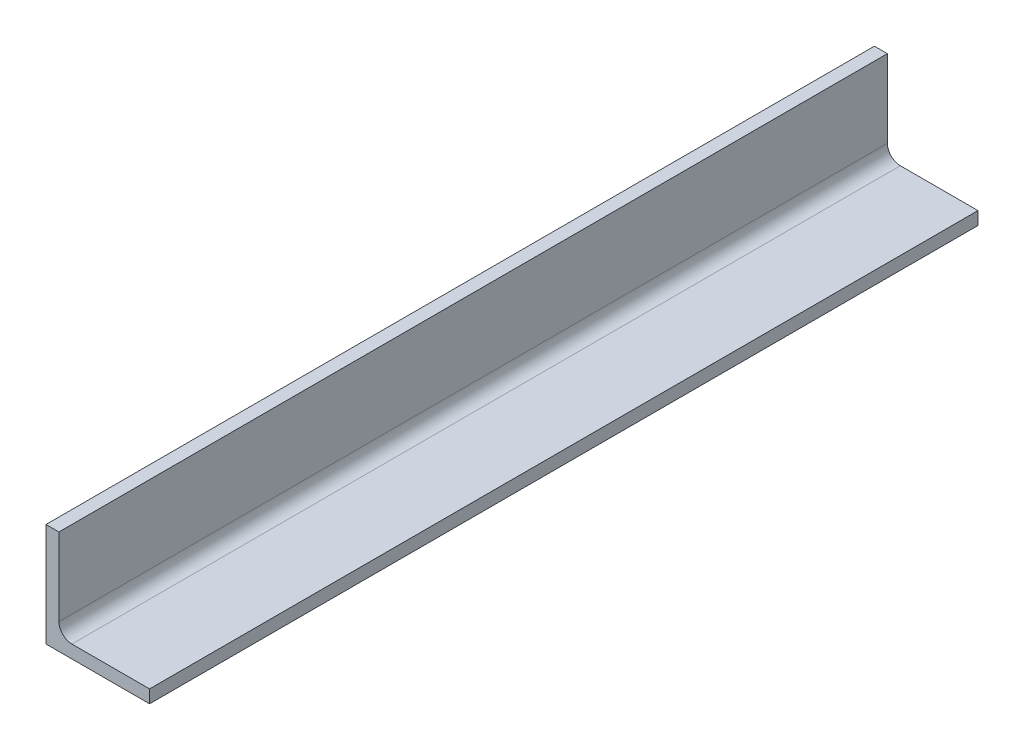
ISO-10303-21;
HEADER;
FILE_DESCRIPTION(('STEP AP214'),'2;1');
FILE_NAME('part.step','',(''),(''),'','','');
FILE_SCHEMA(('AUTOMOTIVE_DESIGN { 1 0 10303 214 1 1 1 1 }'));
ENDSEC;
DATA;
#1=APPLICATION_CONTEXT('core data for automotive mechanical design processes');
#2=APPLICATION_PROTOCOL_DEFINITION('international standard','automotive_design',2000,#1);
#3=PRODUCT_CONTEXT('',#1,'mechanical');
#4=PRODUCT('Part','Part','',(#3));
#5=PRODUCT_RELATED_PRODUCT_CATEGORY('part','',(#4));
#6=PRODUCT_DEFINITION_FORMATION('','',#4);
#7=PRODUCT_DEFINITION_CONTEXT('part definition',#1,'design');
#8=PRODUCT_DEFINITION('design','',#6,#7);
#9=PRODUCT_DEFINITION_SHAPE('','',#8);
#10=(LENGTH_UNIT() NAMED_UNIT(*) SI_UNIT(.MILLI.,.METRE.));
#11=(NAMED_UNIT(*) PLANE_ANGLE_UNIT() SI_UNIT($,.RADIAN.));
#12=(NAMED_UNIT(*) SI_UNIT($,.STERADIAN.) SOLID_ANGLE_UNIT());
#13=UNCERTAINTY_MEASURE_WITH_UNIT(LENGTH_MEASURE(1.E-05),#10,'distance_accuracy_value','');
#14=(GEOMETRIC_REPRESENTATION_CONTEXT(3) GLOBAL_UNCERTAINTY_ASSIGNED_CONTEXT((#13)) GLOBAL_UNIT_ASSIGNED_CONTEXT((#10,
#11,#12)) REPRESENTATION_CONTEXT('',''));
#15=CARTESIAN_POINT('',(0.,0.,0.));
#16=DIRECTION('',(0.,0.,1.));
#17=DIRECTION('',(1.,0.,0.));
#18=AXIS2_PLACEMENT_3D('',#15,#16,#17);
#19=CARTESIAN_POINT('',(50.8,0.,203.2));
#20=DIRECTION('',(0.,1.,0.));
#21=DIRECTION('',(-1.,0.,0.));
#22=AXIS2_PLACEMENT_3D('',#19,#20,#21);
#23=PLANE('',#22);
#24=DIRECTION('',(1.,0.,0.));
#25=VECTOR('',#24,1.);
#26=CARTESIAN_POINT('',(50.8,0.,-203.2));
#27=LINE('',#26,#25);
#28=CARTESIAN_POINT('',(0.,0.,-203.2));
#29=VERTEX_POINT('',#28);
#30=CARTESIAN_POINT('',(50.8,0.,-203.2));
#31=VERTEX_POINT('',#30);
#32=EDGE_CURVE('E107',#29,#31,#27,.T.);
#33=ORIENTED_EDGE('',*,*,#32,.T.);
#34=DIRECTION('',(0.,0.,-1.));
#35=VECTOR('',#34,1.);
#36=CARTESIAN_POINT('',(50.8,0.,203.2));
#37=LINE('',#36,#35);
#38=CARTESIAN_POINT('',(50.8,0.,203.2));
#39=VERTEX_POINT('',#38);
#40=EDGE_CURVE('E11',#39,#31,#37,.T.);
#41=ORIENTED_EDGE('',*,*,#40,.F.);
#42=DIRECTION('',(1.,0.,0.));
#43=VECTOR('',#42,1.);
#44=CARTESIAN_POINT('',(50.8,0.,203.2));
#45=LINE('',#44,#43);
#46=CARTESIAN_POINT('',(0.,0.,203.2));
#47=VERTEX_POINT('',#46);
#48=EDGE_CURVE('E119',#47,#39,#45,.T.);
#49=ORIENTED_EDGE('',*,*,#48,.F.);
#50=DIRECTION('',(0.,0.,-1.));
#51=VECTOR('',#50,1.);
#52=CARTESIAN_POINT('',(0.,0.,203.2));
#53=LINE('',#52,#51);
#54=EDGE_CURVE('E103',#47,#29,#53,.T.);
#55=ORIENTED_EDGE('',*,*,#54,.T.);
#56=EDGE_LOOP('',(#33,#41,#49,#55));
#57=FACE_BOUND('',#56,.T.);
#58=ADVANCED_FACE('F17',(#57),#23,.F.);
#59=CARTESIAN_POINT('',(50.8,6.35,203.2));
#60=DIRECTION('',(-1.,0.,0.));
#61=DIRECTION('',(0.,0.,1.));
#62=AXIS2_PLACEMENT_3D('',#59,#60,#61);
#63=PLANE('',#62);
#64=DIRECTION('',(0.,1.,0.));
#65=VECTOR('',#64,1.);
#66=CARTESIAN_POINT('',(50.8,6.35,-203.2));
#67=LINE('',#66,#65);
#68=CARTESIAN_POINT('',(50.8,6.35,-203.2));
#69=VERTEX_POINT('',#68);
#70=EDGE_CURVE('E110',#31,#69,#67,.T.);
#71=ORIENTED_EDGE('',*,*,#70,.T.);
#72=DIRECTION('',(0.,0.,-1.));
#73=VECTOR('',#72,1.);
#74=CARTESIAN_POINT('',(50.8,6.35,203.2));
#75=LINE('',#74,#73);
#76=CARTESIAN_POINT('',(50.8,6.35,203.2));
#77=VERTEX_POINT('',#76);
#78=EDGE_CURVE('E25',#77,#69,#75,.T.);
#79=ORIENTED_EDGE('',*,*,#78,.F.);
#80=DIRECTION('',(0.,1.,0.));
#81=VECTOR('',#80,1.);
#82=CARTESIAN_POINT('',(50.8,6.35,203.2));
#83=LINE('',#82,#81);
#84=EDGE_CURVE('E73',#39,#77,#83,.T.);
#85=ORIENTED_EDGE('',*,*,#84,.F.);
#86=ORIENTED_EDGE('',*,*,#40,.T.);
#87=EDGE_LOOP('',(#71,#79,#85,#86));
#88=FACE_BOUND('',#87,.T.);
#89=ADVANCED_FACE('F144',(#88),#63,.F.);
#90=CARTESIAN_POINT('',(12.7,6.35,203.2));
#91=DIRECTION('',(0.,-1.,0.));
#92=DIRECTION('',(0.,0.,-1.));
#93=AXIS2_PLACEMENT_3D('',#90,#91,#92);
#94=PLANE('',#93);
#95=DIRECTION('',(-1.,0.,0.));
#96=VECTOR('',#95,1.);
#97=CARTESIAN_POINT('',(12.7,6.35,-203.2));
#98=LINE('',#97,#96);
#99=CARTESIAN_POINT('',(12.7,6.35,-203.2));
#100=VERTEX_POINT('',#99);
#101=EDGE_CURVE('E112',#69,#100,#98,.T.);
#102=ORIENTED_EDGE('',*,*,#101,.T.);
#103=DIRECTION('',(0.,0.,-1.));
#104=VECTOR('',#103,1.);
#105=CARTESIAN_POINT('',(12.7,6.35,203.2));
#106=LINE('',#105,#104);
#107=CARTESIAN_POINT('',(12.7,6.35,203.2));
#108=VERTEX_POINT('',#107);
#109=EDGE_CURVE('E123',#108,#100,#106,.T.);
#110=ORIENTED_EDGE('',*,*,#109,.F.);
#111=DIRECTION('',(-1.,0.,0.));
#112=VECTOR('',#111,1.);
#113=CARTESIAN_POINT('',(12.7,6.35,203.2));
#114=LINE('',#113,#112);
#115=EDGE_CURVE('E131',#77,#108,#114,.T.);
#116=ORIENTED_EDGE('',*,*,#115,.F.);
#117=ORIENTED_EDGE('',*,*,#78,.T.);
#118=EDGE_LOOP('',(#102,#110,#116,#117));
#119=FACE_BOUND('',#118,.T.);
#120=ADVANCED_FACE('F129',(#119),#94,.F.);
#121=CARTESIAN_POINT('',(12.7,12.7,203.2));
#122=DIRECTION('',(0.,0.,-1.));
#123=DIRECTION('',(-1.,0.,0.));
#124=AXIS2_PLACEMENT_3D('',#121,#122,#123);
#125=CYLINDRICAL_SURFACE('',#124,6.35);
#126=CARTESIAN_POINT('',(12.7,12.7,-203.2));
#127=DIRECTION('',(0.,0.,-1.));
#128=DIRECTION('',(-1.,0.,0.));
#129=AXIS2_PLACEMENT_3D('',#126,#127,#128);
#130=CIRCLE('',#129,6.35);
#131=CARTESIAN_POINT('',(6.35,12.7,-203.2));
#132=VERTEX_POINT('',#131);
#133=EDGE_CURVE('E114',#100,#132,#130,.T.);
#134=ORIENTED_EDGE('',*,*,#133,.T.);
#135=DIRECTION('',(0.,0.,-1.));
#136=VECTOR('',#135,1.);
#137=CARTESIAN_POINT('',(6.35,12.7,203.2));
#138=LINE('',#137,#136);
#139=CARTESIAN_POINT('',(6.35,12.7,203.2));
#140=VERTEX_POINT('',#139);
#141=EDGE_CURVE('E98',#140,#132,#138,.T.);
#142=ORIENTED_EDGE('',*,*,#141,.F.);
#143=CARTESIAN_POINT('',(12.7,12.7,203.2));
#144=DIRECTION('',(0.,0.,-1.));
#145=DIRECTION('',(-1.,0.,0.));
#146=AXIS2_PLACEMENT_3D('',#143,#144,#145);
#147=CIRCLE('',#146,6.35);
#148=EDGE_CURVE('E89',#108,#140,#147,.T.);
#149=ORIENTED_EDGE('',*,*,#148,.F.);
#150=ORIENTED_EDGE('',*,*,#109,.T.);
#151=EDGE_LOOP('',(#134,#142,#149,#150));
#152=FACE_BOUND('',#151,.T.);
#153=ADVANCED_FACE('F137',(#152),#125,.F.);
#154=CARTESIAN_POINT('',(6.35,50.8,203.2));
#155=DIRECTION('',(-1.,0.,0.));
#156=DIRECTION('',(0.,-1.,0.));
#157=AXIS2_PLACEMENT_3D('',#154,#155,#156);
#158=PLANE('',#157);
#159=DIRECTION('',(0.,1.,0.));
#160=VECTOR('',#159,1.);
#161=CARTESIAN_POINT('',(6.35,50.8,-203.2));
#162=LINE('',#161,#160);
#163=CARTESIAN_POINT('',(6.35,50.8,-203.2));
#164=VERTEX_POINT('',#163);
#165=EDGE_CURVE('E97',#132,#164,#162,.T.);
#166=ORIENTED_EDGE('',*,*,#165,.T.);
#167=DIRECTION('',(0.,0.,-1.));
#168=VECTOR('',#167,1.);
#169=CARTESIAN_POINT('',(6.35,50.8,203.2));
#170=LINE('',#169,#168);
#171=CARTESIAN_POINT('',(6.35,50.8,203.2));
#172=VERTEX_POINT('',#171);
#173=EDGE_CURVE('E94',#172,#164,#170,.T.);
#174=ORIENTED_EDGE('',*,*,#173,.F.);
#175=DIRECTION('',(0.,1.,0.));
#176=VECTOR('',#175,1.);
#177=CARTESIAN_POINT('',(6.35,50.8,203.2));
#178=LINE('',#177,#176);
#179=EDGE_CURVE('E83',#140,#172,#178,.T.);
#180=ORIENTED_EDGE('',*,*,#179,.F.);
#181=ORIENTED_EDGE('',*,*,#141,.T.);
#182=EDGE_LOOP('',(#166,#174,#180,#181));
#183=FACE_BOUND('',#182,.T.);
#184=ADVANCED_FACE('F95',(#183),#158,.F.);
#185=CARTESIAN_POINT('',(0.,50.8,203.2));
#186=DIRECTION('',(0.,-1.,0.));
#187=DIRECTION('',(0.,0.,-1.));
#188=AXIS2_PLACEMENT_3D('',#185,#186,#187);
#189=PLANE('',#188);
#190=DIRECTION('',(-1.,0.,0.));
#191=VECTOR('',#190,1.);
#192=CARTESIAN_POINT('',(0.,50.8,-203.2));
#193=LINE('',#192,#191);
#194=CARTESIAN_POINT('',(0.,50.8,-203.2));
#195=VERTEX_POINT('',#194);
#196=EDGE_CURVE('E59',#164,#195,#193,.T.);
#197=ORIENTED_EDGE('',*,*,#196,.T.);
#198=DIRECTION('',(0.,0.,-1.));
#199=VECTOR('',#198,1.);
#200=CARTESIAN_POINT('',(0.,50.8,203.2));
#201=LINE('',#200,#199);
#202=CARTESIAN_POINT('',(0.,50.8,203.2));
#203=VERTEX_POINT('',#202);
#204=EDGE_CURVE('E99',#203,#195,#201,.T.);
#205=ORIENTED_EDGE('',*,*,#204,.F.);
#206=DIRECTION('',(-1.,0.,0.));
#207=VECTOR('',#206,1.);
#208=CARTESIAN_POINT('',(0.,50.8,203.2));
#209=LINE('',#208,#207);
#210=EDGE_CURVE('E87',#172,#203,#209,.T.);
#211=ORIENTED_EDGE('',*,*,#210,.F.);
#212=ORIENTED_EDGE('',*,*,#173,.T.);
#213=EDGE_LOOP('',(#197,#205,#211,#212));
#214=FACE_BOUND('',#213,.T.);
#215=ADVANCED_FACE('F101',(#214),#189,.F.);
#216=CARTESIAN_POINT('',(0.,0.,203.2));
#217=DIRECTION('',(1.,0.,0.));
#218=DIRECTION('',(0.,0.,-1.));
#219=AXIS2_PLACEMENT_3D('',#216,#217,#218);
#220=PLANE('',#219);
#221=DIRECTION('',(0.,-1.,0.));
#222=VECTOR('',#221,1.);
#223=CARTESIAN_POINT('',(0.,0.,-203.2));
#224=LINE('',#223,#222);
#225=EDGE_CURVE('E65',#195,#29,#224,.T.);
#226=ORIENTED_EDGE('',*,*,#225,.T.);
#227=ORIENTED_EDGE('',*,*,#54,.F.);
#228=DIRECTION('',(0.,-1.,0.));
#229=VECTOR('',#228,1.);
#230=CARTESIAN_POINT('',(0.,0.,203.2));
#231=LINE('',#230,#229);
#232=EDGE_CURVE('E33',#203,#47,#231,.T.);
#233=ORIENTED_EDGE('',*,*,#232,.F.);
#234=ORIENTED_EDGE('',*,*,#204,.T.);
#235=EDGE_LOOP('',(#226,#227,#233,#234));
#236=FACE_BOUND('',#235,.T.);
#237=ADVANCED_FACE('F160',(#236),#220,.F.);
#238=CARTESIAN_POINT('',(12.7,12.7,203.2));
#239=DIRECTION('',(0.,0.,-1.));
#240=DIRECTION('',(-1.,0.,0.));
#241=AXIS2_PLACEMENT_3D('',#238,#239,#240);
#242=PLANE('',#241);
#243=ORIENTED_EDGE('',*,*,#48,.T.);
#244=ORIENTED_EDGE('',*,*,#84,.T.);
#245=ORIENTED_EDGE('',*,*,#115,.T.);
#246=ORIENTED_EDGE('',*,*,#148,.T.);
#247=ORIENTED_EDGE('',*,*,#179,.T.);
#248=ORIENTED_EDGE('',*,*,#210,.T.);
#249=ORIENTED_EDGE('',*,*,#232,.T.);
#250=EDGE_LOOP('',(#243,#244,#245,#246,#247,#248,#249));
#251=FACE_BOUND('',#250,.T.);
#252=ADVANCED_FACE('F85',(#251),#242,.F.);
#253=CARTESIAN_POINT('',(12.7,12.7,-203.2));
#254=DIRECTION('',(0.,0.,-1.));
#255=DIRECTION('',(-1.,0.,0.));
#256=AXIS2_PLACEMENT_3D('',#253,#254,#255);
#257=PLANE('',#256);
#258=ORIENTED_EDGE('',*,*,#32,.F.);
#259=ORIENTED_EDGE('',*,*,#225,.F.);
#260=ORIENTED_EDGE('',*,*,#196,.F.);
#261=ORIENTED_EDGE('',*,*,#165,.F.);
#262=ORIENTED_EDGE('',*,*,#133,.F.);
#263=ORIENTED_EDGE('',*,*,#101,.F.);
#264=ORIENTED_EDGE('',*,*,#70,.F.);
#265=EDGE_LOOP('',(#258,#259,#260,#261,#262,#263,#264));
#266=FACE_BOUND('',#265,.T.);
#267=ADVANCED_FACE('F135',(#266),#257,.T.);
#268=CLOSED_SHELL('',(#58,#89,#120,#153,#184,#215,#237,#252,#267));
#269=MANIFOLD_SOLID_BREP('B1',#268);
#270=ADVANCED_BREP_SHAPE_REPRESENTATION('',(#18,#269),#14);
#271=SHAPE_DEFINITION_REPRESENTATION(#9,#270);
ENDSEC;
END-ISO-10303-21;
